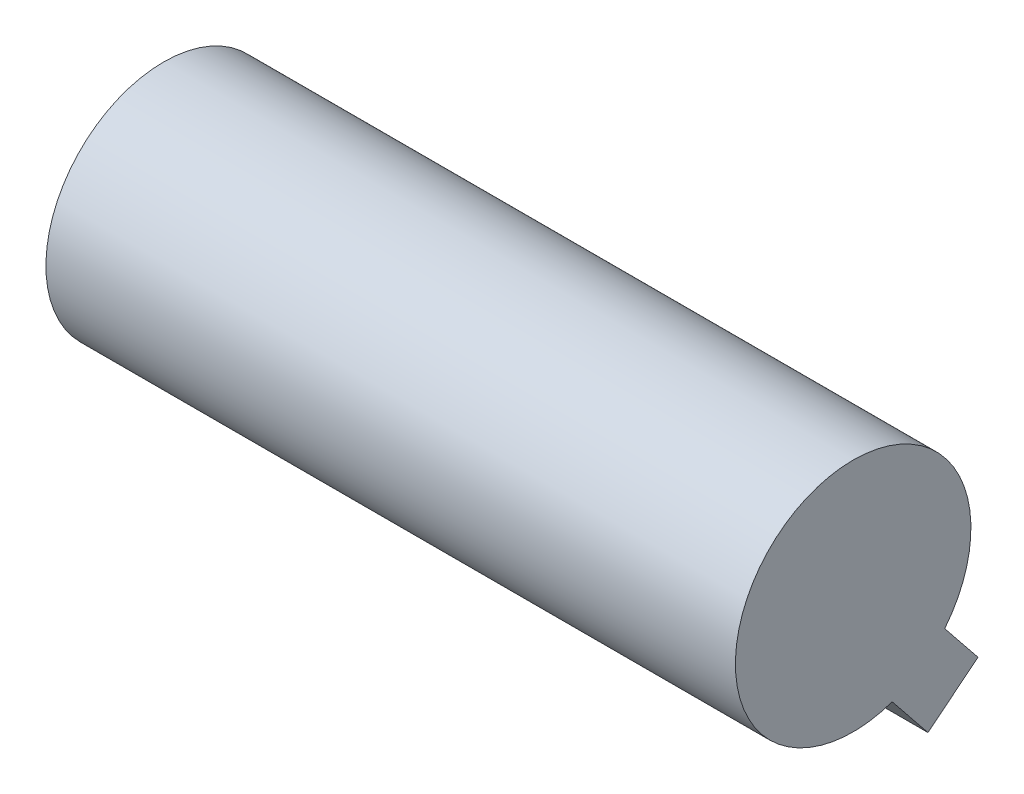
ISO-10303-21;
HEADER;
FILE_DESCRIPTION(('STEP AP214'),'2;1');
FILE_NAME('part.step','',(''),(''),'','','');
FILE_SCHEMA(('AUTOMOTIVE_DESIGN { 1 0 10303 214 1 1 1 1 }'));
ENDSEC;
DATA;
#1=APPLICATION_CONTEXT('core data for automotive mechanical design processes');
#2=APPLICATION_PROTOCOL_DEFINITION('international standard','automotive_design',2000,#1);
#3=PRODUCT_CONTEXT('',#1,'mechanical');
#4=PRODUCT('Part','Part','',(#3));
#5=PRODUCT_RELATED_PRODUCT_CATEGORY('part','',(#4));
#6=PRODUCT_DEFINITION_FORMATION('','',#4);
#7=PRODUCT_DEFINITION_CONTEXT('part definition',#1,'design');
#8=PRODUCT_DEFINITION('design','',#6,#7);
#9=PRODUCT_DEFINITION_SHAPE('','',#8);
#10=(LENGTH_UNIT() NAMED_UNIT(*) SI_UNIT(.MILLI.,.METRE.));
#11=(NAMED_UNIT(*) PLANE_ANGLE_UNIT() SI_UNIT($,.RADIAN.));
#12=(NAMED_UNIT(*) SI_UNIT($,.STERADIAN.) SOLID_ANGLE_UNIT());
#13=UNCERTAINTY_MEASURE_WITH_UNIT(LENGTH_MEASURE(1.E-05),#10,'distance_accuracy_value','');
#14=(GEOMETRIC_REPRESENTATION_CONTEXT(3) GLOBAL_UNCERTAINTY_ASSIGNED_CONTEXT((#13)) GLOBAL_UNIT_ASSIGNED_CONTEXT((#10,
#11,#12)) REPRESENTATION_CONTEXT('',''));
#15=CARTESIAN_POINT('',(0.,0.,0.));
#16=DIRECTION('',(0.,0.,1.));
#17=DIRECTION('',(1.,0.,0.));
#18=AXIS2_PLACEMENT_3D('',#15,#16,#17);
#19=CARTESIAN_POINT('',(40.99,0.,0.));
#20=DIRECTION('',(-1.,0.,0.));
#21=DIRECTION('',(0.,0.,1.));
#22=AXIS2_PLACEMENT_3D('',#19,#20,#21);
#23=CYLINDRICAL_SURFACE('',#22,7.);
#24=CARTESIAN_POINT('',(26.3736029328438,0.,0.));
#25=DIRECTION('',(1.,0.,0.));
#26=DIRECTION('',(0.,0.,-1.));
#27=AXIS2_PLACEMENT_3D('',#24,#25,#26);
#28=CIRCLE('',#27,7.);
#29=CARTESIAN_POINT('',(26.3736029328438,-6.60524430472105,-2.31748736241435));
#30=VERTEX_POINT('',#29);
#31=CARTESIAN_POINT('',(26.3736029328438,-4.40252834253966,-5.44221868295781));
#32=VERTEX_POINT('',#31);
#33=EDGE_CURVE('E48',#30,#32,#28,.T.);
#34=ORIENTED_EDGE('',*,*,#33,.F.);
#35=DIRECTION('',(-1.,0.,0.));
#36=VECTOR('',#35,1.);
#37=CARTESIAN_POINT('',(40.99,-6.60524430472104,-2.31748736241435));
#38=LINE('',#37,#36);
#39=CARTESIAN_POINT('',(40.99,-6.60524430472104,-2.31748736241435));
#40=VERTEX_POINT('',#39);
#41=EDGE_CURVE('E176',#40,#30,#38,.T.);
#42=ORIENTED_EDGE('',*,*,#41,.F.);
#43=CARTESIAN_POINT('',(40.99,0.,0.));
#44=DIRECTION('',(1.,0.,0.));
#45=DIRECTION('',(0.,0.,-1.));
#46=AXIS2_PLACEMENT_3D('',#43,#44,#45);
#47=CIRCLE('',#46,7.);
#48=CARTESIAN_POINT('',(40.99,-4.40252834253966,-5.44221868295781));
#49=VERTEX_POINT('',#48);
#50=EDGE_CURVE('E184',#49,#40,#47,.T.);
#51=ORIENTED_EDGE('',*,*,#50,.F.);
#52=DIRECTION('',(-1.,0.,0.));
#53=VECTOR('',#52,1.);
#54=CARTESIAN_POINT('',(40.99,-4.40252834253966,-5.44221868295781));
#55=LINE('',#54,#53);
#56=EDGE_CURVE('E180',#32,#49,#55,.F.);
#57=ORIENTED_EDGE('',*,*,#56,.F.);
#58=EDGE_LOOP('',(#34,#42,#51,#57));
#59=FACE_BOUND('',#58,.T.);
#60=CARTESIAN_POINT('',(14.3372261747256,0.,0.));
#61=DIRECTION('',(-1.,0.,0.));
#62=DIRECTION('',(0.,0.,1.));
#63=AXIS2_PLACEMENT_3D('',#60,#61,#62);
#64=CIRCLE('',#63,7.);
#65=CARTESIAN_POINT('',(14.3372261747256,-4.40252834253966,-5.44221868295781));
#66=VERTEX_POINT('',#65);
#67=CARTESIAN_POINT('',(14.3372261747256,-6.60524430472104,-2.31748736241435));
#68=VERTEX_POINT('',#67);
#69=EDGE_CURVE('E11',#66,#68,#64,.T.);
#70=ORIENTED_EDGE('',*,*,#69,.F.);
#71=DIRECTION('',(-1.,0.,0.));
#72=VECTOR('',#71,1.);
#73=CARTESIAN_POINT('',(40.99,-4.40252834253966,-5.44221868295781));
#74=LINE('',#73,#72);
#75=CARTESIAN_POINT('',(0.,-4.40252834253966,-5.44221868295781));
#76=VERTEX_POINT('',#75);
#77=EDGE_CURVE('E145',#76,#66,#74,.F.);
#78=ORIENTED_EDGE('',*,*,#77,.F.);
#79=CARTESIAN_POINT('',(0.,0.,0.));
#80=DIRECTION('',(1.,0.,0.));
#81=DIRECTION('',(0.,0.,-1.));
#82=AXIS2_PLACEMENT_3D('',#79,#80,#81);
#83=CIRCLE('',#82,7.);
#84=CARTESIAN_POINT('',(0.,-6.60524430472105,-2.31748736241435));
#85=VERTEX_POINT('',#84);
#86=EDGE_CURVE('E108',#76,#85,#83,.T.);
#87=ORIENTED_EDGE('',*,*,#86,.T.);
#88=DIRECTION('',(-1.,0.,0.));
#89=VECTOR('',#88,1.);
#90=CARTESIAN_POINT('',(40.99,-6.60524430472104,-2.31748736241435));
#91=LINE('',#90,#89);
#92=EDGE_CURVE('E58',#68,#85,#91,.T.);
#93=ORIENTED_EDGE('',*,*,#92,.F.);
#94=EDGE_LOOP('',(#70,#78,#87,#93));
#95=FACE_BOUND('',#94,.T.);
#96=ADVANCED_FACE('F40',(#59,#95),#23,.T.);
#97=CARTESIAN_POINT('',(40.99,0.,0.));
#98=DIRECTION('',(1.,0.,0.));
#99=DIRECTION('',(0.,0.,-1.));
#100=AXIS2_PLACEMENT_3D('',#97,#98,#99);
#101=PLANE('',#100);
#102=DIRECTION('',(0.,-0.779635416221289,-0.6262336766523));
#103=VECTOR('',#102,1.);
#104=CARTESIAN_POINT('',(40.99,0.880012735948902,3.6949640215743));
#105=LINE('',#104,#103);
#106=CARTESIAN_POINT('',(40.99,-9.25524767492786,-4.4460737749056));
#107=VERTEX_POINT('',#106);
#108=EDGE_CURVE('E164',#40,#107,#105,.T.);
#109=ORIENTED_EDGE('',*,*,#108,.T.);
#110=DIRECTION('',(0.,-0.6262336766523,0.779635416221289));
#111=VECTOR('',#110,1.);
#112=CARTESIAN_POINT('',(40.99,-9.25524767492786,-4.4460737749056));
#113=LINE('',#112,#111);
#114=CARTESIAN_POINT('',(40.99,-6.86581167553546,-7.42082425443745));
#115=VERTEX_POINT('',#114);
#116=EDGE_CURVE('E148',#115,#107,#113,.T.);
#117=ORIENTED_EDGE('',*,*,#116,.F.);
#118=DIRECTION('',(0.,-0.779635416221289,-0.6262336766523));
#119=VECTOR('',#118,1.);
#120=CARTESIAN_POINT('',(40.99,3.2694487353413,0.720213542042446));
#121=LINE('',#120,#119);
#122=EDGE_CURVE('E173',#49,#115,#121,.T.);
#123=ORIENTED_EDGE('',*,*,#122,.F.);
#124=ORIENTED_EDGE('',*,*,#50,.T.);
#125=EDGE_LOOP('',(#109,#117,#123,#124));
#126=FACE_BOUND('',#125,.T.);
#127=ADVANCED_FACE('F206',(#126),#101,.T.);
#128=CARTESIAN_POINT('',(0.,0.,0.));
#129=DIRECTION('',(1.,0.,0.));
#130=DIRECTION('',(0.,0.,-1.));
#131=AXIS2_PLACEMENT_3D('',#128,#129,#130);
#132=PLANE('',#131);
#133=ORIENTED_EDGE('',*,*,#86,.F.);
#134=DIRECTION('',(0.,-0.779635416221289,-0.6262336766523));
#135=VECTOR('',#134,1.);
#136=CARTESIAN_POINT('',(0.,3.2694487353413,0.720213542042446));
#137=LINE('',#136,#135);
#138=CARTESIAN_POINT('',(0.,-6.86581167553546,-7.42082425443745));
#139=VERTEX_POINT('',#138);
#140=EDGE_CURVE('E102',#76,#139,#137,.T.);
#141=ORIENTED_EDGE('',*,*,#140,.T.);
#142=DIRECTION('',(0.,0.6262336766523,-0.779635416221289));
#143=VECTOR('',#142,1.);
#144=CARTESIAN_POINT('',(0.,-9.25524767492786,-4.4460737749056));
#145=LINE('',#144,#143);
#146=CARTESIAN_POINT('',(0.,-9.25524767492786,-4.4460737749056));
#147=VERTEX_POINT('',#146);
#148=EDGE_CURVE('E107',#147,#139,#145,.T.);
#149=ORIENTED_EDGE('',*,*,#148,.F.);
#150=DIRECTION('',(0.,-0.779635416221289,-0.6262336766523));
#151=VECTOR('',#150,1.);
#152=CARTESIAN_POINT('',(0.,0.880012735948901,3.6949640215743));
#153=LINE('',#152,#151);
#154=EDGE_CURVE('E112',#85,#147,#153,.T.);
#155=ORIENTED_EDGE('',*,*,#154,.F.);
#156=EDGE_LOOP('',(#133,#141,#149,#155));
#157=FACE_BOUND('',#156,.T.);
#158=ADVANCED_FACE('F104',(#157),#132,.F.);
#159=CARTESIAN_POINT('',(26.3736029328438,0.880012735948902,3.6949640215743));
#160=DIRECTION('',(1.,0.,0.));
#161=DIRECTION('',(0.,0.,-1.));
#162=AXIS2_PLACEMENT_3D('',#159,#160,#161);
#163=PLANE('',#162);
#164=DIRECTION('',(0.,-0.779635416221289,-0.6262336766523));
#165=VECTOR('',#164,1.);
#166=CARTESIAN_POINT('',(26.3736029328438,0.880012735948902,3.6949640215743));
#167=LINE('',#166,#165);
#168=CARTESIAN_POINT('',(26.3736029328438,-9.25524767492786,-4.4460737749056));
#169=VERTEX_POINT('',#168);
#170=EDGE_CURVE('E167',#30,#169,#167,.T.);
#171=ORIENTED_EDGE('',*,*,#170,.F.);
#172=ORIENTED_EDGE('',*,*,#33,.T.);
#173=DIRECTION('',(0.,-0.779635416221289,-0.6262336766523));
#174=VECTOR('',#173,1.);
#175=CARTESIAN_POINT('',(26.3736029328438,3.2694487353413,0.720213542042446));
#176=LINE('',#175,#174);
#177=CARTESIAN_POINT('',(26.3736029328438,-6.86581167553546,-7.42082425443745));
#178=VERTEX_POINT('',#177);
#179=EDGE_CURVE('E170',#32,#178,#176,.T.);
#180=ORIENTED_EDGE('',*,*,#179,.T.);
#181=DIRECTION('',(0.,0.6262336766523,-0.779635416221289));
#182=VECTOR('',#181,1.);
#183=CARTESIAN_POINT('',(26.3736029328438,-9.25524767492786,-4.4460737749056));
#184=LINE('',#183,#182);
#185=EDGE_CURVE('E156',#169,#178,#184,.T.);
#186=ORIENTED_EDGE('',*,*,#185,.F.);
#187=EDGE_LOOP('',(#171,#172,#180,#186));
#188=FACE_BOUND('',#187,.T.);
#189=ADVANCED_FACE('F195',(#188),#163,.F.);
#190=CARTESIAN_POINT('',(40.99,3.2694487353413,0.720213542042446));
#191=DIRECTION('',(0.,-0.6262336766523,0.779635416221289));
#192=DIRECTION('',(0.,-0.779635416221289,-0.6262336766523));
#193=AXIS2_PLACEMENT_3D('',#190,#191,#192);
#194=PLANE('',#193);
#195=ORIENTED_EDGE('',*,*,#179,.F.);
#196=ORIENTED_EDGE('',*,*,#56,.T.);
#197=ORIENTED_EDGE('',*,*,#122,.T.);
#198=DIRECTION('',(1.,0.,0.));
#199=VECTOR('',#198,1.);
#200=CARTESIAN_POINT('',(40.99,-6.86581167553546,-7.42082425443745));
#201=LINE('',#200,#199);
#202=EDGE_CURVE('E160',#178,#115,#201,.T.);
#203=ORIENTED_EDGE('',*,*,#202,.F.);
#204=EDGE_LOOP('',(#195,#196,#197,#203));
#205=FACE_BOUND('',#204,.T.);
#206=ADVANCED_FACE('F200',(#205),#194,.F.);
#207=CARTESIAN_POINT('',(40.99,0.880012735948902,3.6949640215743));
#208=DIRECTION('',(0.,0.6262336766523,-0.779635416221289));
#209=DIRECTION('',(0.,0.779635416221289,0.6262336766523));
#210=AXIS2_PLACEMENT_3D('',#207,#208,#209);
#211=PLANE('',#210);
#212=ORIENTED_EDGE('',*,*,#108,.F.);
#213=ORIENTED_EDGE('',*,*,#41,.T.);
#214=ORIENTED_EDGE('',*,*,#170,.T.);
#215=DIRECTION('',(-1.,0.,0.));
#216=VECTOR('',#215,1.);
#217=CARTESIAN_POINT('',(40.99,-9.25524767492786,-4.4460737749056));
#218=LINE('',#217,#216);
#219=EDGE_CURVE('E152',#107,#169,#218,.T.);
#220=ORIENTED_EDGE('',*,*,#219,.F.);
#221=EDGE_LOOP('',(#212,#213,#214,#220));
#222=FACE_BOUND('',#221,.T.);
#223=ADVANCED_FACE('F210',(#222),#211,.F.);
#224=CARTESIAN_POINT('',(0.,-7.79635416221289,-6.262336766523));
#225=DIRECTION('',(0.,0.779635416221289,0.6262336766523));
#226=DIRECTION('',(0.,-0.6262336766523,0.779635416221289));
#227=AXIS2_PLACEMENT_3D('',#224,#225,#226);
#228=PLANE('',#227);
#229=ORIENTED_EDGE('',*,*,#116,.T.);
#230=ORIENTED_EDGE('',*,*,#219,.T.);
#231=ORIENTED_EDGE('',*,*,#185,.T.);
#232=ORIENTED_EDGE('',*,*,#202,.T.);
#233=EDGE_LOOP('',(#229,#230,#231,#232));
#234=FACE_BOUND('',#233,.T.);
#235=ADVANCED_FACE('F204',(#234),#228,.F.);
#236=CARTESIAN_POINT('',(14.3372261747256,3.2694487353413,0.720213542042446));
#237=DIRECTION('',(-1.,0.,0.));
#238=DIRECTION('',(0.,0.,1.));
#239=AXIS2_PLACEMENT_3D('',#236,#237,#238);
#240=PLANE('',#239);
#241=DIRECTION('',(0.,-0.779635416221289,-0.6262336766523));
#242=VECTOR('',#241,1.);
#243=CARTESIAN_POINT('',(14.3372261747256,3.2694487353413,0.720213542042446));
#244=LINE('',#243,#242);
#245=CARTESIAN_POINT('',(14.3372261747256,-6.86581167553546,-7.42082425443745));
#246=VERTEX_POINT('',#245);
#247=EDGE_CURVE('E111',#66,#246,#244,.T.);
#248=ORIENTED_EDGE('',*,*,#247,.F.);
#249=ORIENTED_EDGE('',*,*,#69,.T.);
#250=DIRECTION('',(0.,-0.779635416221289,-0.6262336766523));
#251=VECTOR('',#250,1.);
#252=CARTESIAN_POINT('',(14.3372261747256,0.880012735948901,3.6949640215743));
#253=LINE('',#252,#251);
#254=CARTESIAN_POINT('',(14.3372261747256,-9.25524767492786,-4.4460737749056));
#255=VERTEX_POINT('',#254);
#256=EDGE_CURVE('E136',#68,#255,#253,.T.);
#257=ORIENTED_EDGE('',*,*,#256,.T.);
#258=DIRECTION('',(0.,-0.6262336766523,0.779635416221289));
#259=VECTOR('',#258,1.);
#260=CARTESIAN_POINT('',(14.3372261747256,-9.25524767492786,-4.4460737749056));
#261=LINE('',#260,#259);
#262=EDGE_CURVE('E122',#246,#255,#261,.T.);
#263=ORIENTED_EDGE('',*,*,#262,.F.);
#264=EDGE_LOOP('',(#248,#249,#257,#263));
#265=FACE_BOUND('',#264,.T.);
#266=ADVANCED_FACE('F228',(#265),#240,.F.);
#267=CARTESIAN_POINT('',(14.3372261747256,3.2694487353413,0.720213542042446));
#268=DIRECTION('',(0.,-0.6262336766523,0.779635416221289));
#269=DIRECTION('',(0.,-0.779635416221289,-0.6262336766523));
#270=AXIS2_PLACEMENT_3D('',#267,#268,#269);
#271=PLANE('',#270);
#272=ORIENTED_EDGE('',*,*,#140,.F.);
#273=ORIENTED_EDGE('',*,*,#77,.T.);
#274=ORIENTED_EDGE('',*,*,#247,.T.);
#275=DIRECTION('',(1.,0.,0.));
#276=VECTOR('',#275,1.);
#277=CARTESIAN_POINT('',(0.,-6.86581167553546,-7.42082425443745));
#278=LINE('',#277,#276);
#279=EDGE_CURVE('E115',#139,#246,#278,.T.);
#280=ORIENTED_EDGE('',*,*,#279,.F.);
#281=EDGE_LOOP('',(#272,#273,#274,#280));
#282=FACE_BOUND('',#281,.T.);
#283=ADVANCED_FACE('F116',(#282),#271,.F.);
#284=CARTESIAN_POINT('',(14.3372261747256,0.880012735948901,3.6949640215743));
#285=DIRECTION('',(0.,0.6262336766523,-0.779635416221289));
#286=DIRECTION('',(0.,0.779635416221289,0.6262336766523));
#287=AXIS2_PLACEMENT_3D('',#284,#285,#286);
#288=PLANE('',#287);
#289=ORIENTED_EDGE('',*,*,#256,.F.);
#290=ORIENTED_EDGE('',*,*,#92,.T.);
#291=ORIENTED_EDGE('',*,*,#154,.T.);
#292=DIRECTION('',(-1.,0.,0.));
#293=VECTOR('',#292,1.);
#294=CARTESIAN_POINT('',(0.,-9.25524767492786,-4.4460737749056));
#295=LINE('',#294,#293);
#296=EDGE_CURVE('E127',#255,#147,#295,.T.);
#297=ORIENTED_EDGE('',*,*,#296,.F.);
#298=EDGE_LOOP('',(#289,#290,#291,#297));
#299=FACE_BOUND('',#298,.T.);
#300=ADVANCED_FACE('F234',(#299),#288,.F.);
#301=CARTESIAN_POINT('',(0.,-7.79635416221289,-6.262336766523));
#302=DIRECTION('',(0.,-0.779635416221289,-0.6262336766523));
#303=DIRECTION('',(0.,0.6262336766523,-0.779635416221289));
#304=AXIS2_PLACEMENT_3D('',#301,#302,#303);
#305=PLANE('',#304);
#306=ORIENTED_EDGE('',*,*,#148,.T.);
#307=ORIENTED_EDGE('',*,*,#279,.T.);
#308=ORIENTED_EDGE('',*,*,#262,.T.);
#309=ORIENTED_EDGE('',*,*,#296,.T.);
#310=EDGE_LOOP('',(#306,#307,#308,#309));
#311=FACE_BOUND('',#310,.T.);
#312=ADVANCED_FACE('F125',(#311),#305,.T.);
#313=CLOSED_SHELL('',(#96,#127,#158,#189,#206,#223,#235,#266,#283,#300,#312));
#314=MANIFOLD_SOLID_BREP('B2',#313);
#315=ADVANCED_BREP_SHAPE_REPRESENTATION('',(#18,#314),#14);
#316=SHAPE_DEFINITION_REPRESENTATION(#9,#315);
ENDSEC;
END-ISO-10303-21;
